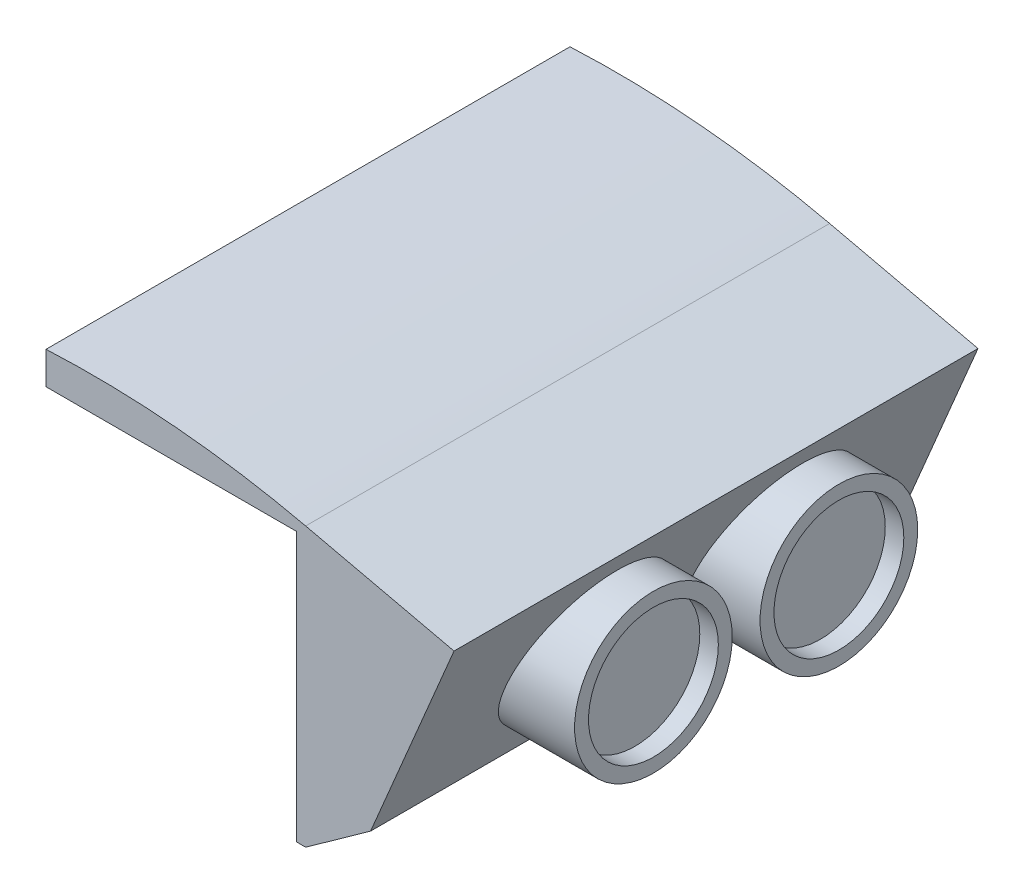
ISO-10303-21;
HEADER;
FILE_DESCRIPTION(('STEP AP214'),'2;1');
FILE_NAME('part.step','',(''),(''),'','','');
FILE_SCHEMA(('AUTOMOTIVE_DESIGN { 1 0 10303 214 1 1 1 1 }'));
ENDSEC;
DATA;
#1=APPLICATION_CONTEXT('core data for automotive mechanical design processes');
#2=APPLICATION_PROTOCOL_DEFINITION('international standard','automotive_design',2000,#1);
#3=PRODUCT_CONTEXT('',#1,'mechanical');
#4=PRODUCT('Part','Part','',(#3));
#5=PRODUCT_RELATED_PRODUCT_CATEGORY('part','',(#4));
#6=PRODUCT_DEFINITION_FORMATION('','',#4);
#7=PRODUCT_DEFINITION_CONTEXT('part definition',#1,'design');
#8=PRODUCT_DEFINITION('design','',#6,#7);
#9=PRODUCT_DEFINITION_SHAPE('','',#8);
#10=(LENGTH_UNIT() NAMED_UNIT(*) SI_UNIT(.MILLI.,.METRE.));
#11=(NAMED_UNIT(*) PLANE_ANGLE_UNIT() SI_UNIT($,.RADIAN.));
#12=(NAMED_UNIT(*) SI_UNIT($,.STERADIAN.) SOLID_ANGLE_UNIT());
#13=UNCERTAINTY_MEASURE_WITH_UNIT(LENGTH_MEASURE(1.E-05),#10,'distance_accuracy_value','');
#14=(GEOMETRIC_REPRESENTATION_CONTEXT(3) GLOBAL_UNCERTAINTY_ASSIGNED_CONTEXT((#13)) GLOBAL_UNIT_ASSIGNED_CONTEXT((#10,
#11,#12)) REPRESENTATION_CONTEXT('',''));
#15=CARTESIAN_POINT('',(0.,0.,0.));
#16=DIRECTION('',(0.,0.,1.));
#17=DIRECTION('',(1.,0.,0.));
#18=AXIS2_PLACEMENT_3D('',#15,#16,#17);
#19=CARTESIAN_POINT('',(-15.,-1.5,17.5));
#20=DIRECTION('',(0.,0.,-1.));
#21=DIRECTION('',(1.,0.,0.));
#22=AXIS2_PLACEMENT_3D('',#19,#20,#21);
#23=PLANE('',#22);
#24=DIRECTION('',(-1.,0.,0.));
#25=VECTOR('',#24,1.);
#26=CARTESIAN_POINT('',(-14.,-1.,17.5));
#27=LINE('',#26,#25);
#28=CARTESIAN_POINT('',(-12.5,-1.,17.5));
#29=VERTEX_POINT('',#28);
#30=CARTESIAN_POINT('',(-14.,-1.,17.5));
#31=VERTEX_POINT('',#30);
#32=EDGE_CURVE('E237',#29,#31,#27,.T.);
#33=ORIENTED_EDGE('',*,*,#32,.F.);
#34=DIRECTION('',(0.832050294337844,0.554700196225229,0.));
#35=VECTOR('',#34,1.);
#36=CARTESIAN_POINT('',(-14.,-2.,17.5));
#37=LINE('',#36,#35);
#38=CARTESIAN_POINT('',(-14.,-2.,17.5));
#39=VERTEX_POINT('',#38);
#40=EDGE_CURVE('E239',#39,#29,#37,.T.);
#41=ORIENTED_EDGE('',*,*,#40,.F.);
#42=DIRECTION('',(-1.,0.,0.));
#43=VECTOR('',#42,1.);
#44=CARTESIAN_POINT('',(-14.,-2.,17.5));
#45=LINE('',#44,#43);
#46=CARTESIAN_POINT('',(-15.,-2.,17.5));
#47=VERTEX_POINT('',#46);
#48=EDGE_CURVE('E243',#39,#47,#45,.T.);
#49=ORIENTED_EDGE('',*,*,#48,.T.);
#50=CARTESIAN_POINT('',(-15.,-1.5,17.5));
#51=DIRECTION('',(0.,0.,1.));
#52=DIRECTION('',(1.,0.,0.));
#53=AXIS2_PLACEMENT_3D('',#50,#51,#52);
#54=CIRCLE('',#53,0.5);
#55=CARTESIAN_POINT('',(-15.,-1.,17.5));
#56=VERTEX_POINT('',#55);
#57=EDGE_CURVE('E245',#56,#47,#54,.T.);
#58=ORIENTED_EDGE('',*,*,#57,.F.);
#59=EDGE_CURVE('E240',#31,#56,#27,.T.);
#60=ORIENTED_EDGE('',*,*,#59,.F.);
#61=EDGE_LOOP('',(#33,#41,#49,#58,#60));
#62=FACE_BOUND('',#61,.T.);
#63=CARTESIAN_POINT('',(-15.,-1.5,17.5));
#64=DIRECTION('',(0.,0.,-1.));
#65=DIRECTION('',(-1.,0.,0.));
#66=AXIS2_PLACEMENT_3D('',#63,#64,#65);
#67=CIRCLE('',#66,0.349999999999999);
#68=CARTESIAN_POINT('',(-15.35,-1.5,17.5));
#69=VERTEX_POINT('',#68);
#70=EDGE_CURVE('E233',#69,#69,#67,.T.);
#71=ORIENTED_EDGE('',*,*,#70,.F.);
#72=EDGE_LOOP('',(#71));
#73=FACE_BOUND('',#72,.T.);
#74=ADVANCED_FACE('F36',(#62,#73),#23,.T.);
#75=CARTESIAN_POINT('',(-15.,-1.5,22.5));
#76=DIRECTION('',(0.,0.,-1.));
#77=DIRECTION('',(1.,0.,0.));
#78=AXIS2_PLACEMENT_3D('',#75,#76,#77);
#79=PLANE('',#78);
#80=DIRECTION('',(-1.,0.,0.));
#81=VECTOR('',#80,1.);
#82=CARTESIAN_POINT('',(-12.5,-1.,22.5));
#83=LINE('',#82,#81);
#84=CARTESIAN_POINT('',(-12.5,-1.,22.5));
#85=VERTEX_POINT('',#84);
#86=CARTESIAN_POINT('',(-14.,-1.,22.5));
#87=VERTEX_POINT('',#86);
#88=EDGE_CURVE('E56',#85,#87,#83,.T.);
#89=ORIENTED_EDGE('',*,*,#88,.T.);
#90=CARTESIAN_POINT('',(-15.,-1.,22.5));
#91=VERTEX_POINT('',#90);
#92=EDGE_CURVE('E236',#87,#91,#83,.T.);
#93=ORIENTED_EDGE('',*,*,#92,.T.);
#94=CARTESIAN_POINT('',(-15.,-1.5,22.5));
#95=DIRECTION('',(0.,0.,1.));
#96=DIRECTION('',(1.,0.,0.));
#97=AXIS2_PLACEMENT_3D('',#94,#95,#96);
#98=CIRCLE('',#97,0.5);
#99=CARTESIAN_POINT('',(-15.,-2.,22.5));
#100=VERTEX_POINT('',#99);
#101=EDGE_CURVE('E256',#91,#100,#98,.T.);
#102=ORIENTED_EDGE('',*,*,#101,.T.);
#103=DIRECTION('',(-1.,0.,0.));
#104=VECTOR('',#103,1.);
#105=CARTESIAN_POINT('',(-14.,-2.,22.5));
#106=LINE('',#105,#104);
#107=CARTESIAN_POINT('',(-14.,-2.,22.5));
#108=VERTEX_POINT('',#107);
#109=EDGE_CURVE('E253',#108,#100,#106,.T.);
#110=ORIENTED_EDGE('',*,*,#109,.F.);
#111=DIRECTION('',(0.832050294337844,0.554700196225229,0.));
#112=VECTOR('',#111,1.);
#113=CARTESIAN_POINT('',(-14.,-2.,22.5));
#114=LINE('',#113,#112);
#115=EDGE_CURVE('E250',#108,#85,#114,.T.);
#116=ORIENTED_EDGE('',*,*,#115,.T.);
#117=EDGE_LOOP('',(#89,#93,#102,#110,#116));
#118=FACE_BOUND('',#117,.T.);
#119=CARTESIAN_POINT('',(-15.,-1.5,22.5));
#120=DIRECTION('',(0.,0.,-1.));
#121=DIRECTION('',(-1.,0.,0.));
#122=AXIS2_PLACEMENT_3D('',#119,#120,#121);
#123=CIRCLE('',#122,0.349999999999999);
#124=CARTESIAN_POINT('',(-15.35,-1.5,22.5));
#125=VERTEX_POINT('',#124);
#126=EDGE_CURVE('E230',#125,#125,#123,.T.);
#127=ORIENTED_EDGE('',*,*,#126,.T.);
#128=EDGE_LOOP('',(#127));
#129=FACE_BOUND('',#128,.T.);
#130=ADVANCED_FACE('F411',(#118,#129),#79,.F.);
#131=CARTESIAN_POINT('',(-14.,-30.,-28.25));
#132=DIRECTION('',(-1.,0.,0.));
#133=DIRECTION('',(0.,0.,1.));
#134=AXIS2_PLACEMENT_3D('',#131,#132,#133);
#135=PLANE('',#134);
#136=DIRECTION('',(0.,0.,-1.));
#137=VECTOR('',#136,1.);
#138=CARTESIAN_POINT('',(-14.,-6.63508326896291,56.0154341555881));
#139=LINE('',#138,#137);
#140=CARTESIAN_POINT('',(-14.,-6.63508326896291,-27.25));
#141=VERTEX_POINT('',#140);
#142=CARTESIAN_POINT('',(-14.,-6.63508326896291,-28.25));
#143=VERTEX_POINT('',#142);
#144=EDGE_CURVE('E334',#141,#143,#139,.T.);
#145=ORIENTED_EDGE('',*,*,#144,.F.);
#146=DIRECTION('',(0.,1.,0.));
#147=VECTOR('',#146,1.);
#148=CARTESIAN_POINT('',(-14.,-30.,-27.25));
#149=LINE('',#148,#147);
#150=CARTESIAN_POINT('',(-14.,-1.,-27.25));
#151=VERTEX_POINT('',#150);
#152=EDGE_CURVE('E313',#141,#151,#149,.T.);
#153=ORIENTED_EDGE('',*,*,#152,.T.);
#154=DIRECTION('',(0.,0.,1.));
#155=VECTOR('',#154,1.);
#156=CARTESIAN_POINT('',(-14.,-1.,0.));
#157=LINE('',#156,#155);
#158=CARTESIAN_POINT('',(-14.,-1.,-22.5));
#159=VERTEX_POINT('',#158);
#160=EDGE_CURVE('E328',#151,#159,#157,.T.);
#161=ORIENTED_EDGE('',*,*,#160,.T.);
#162=CARTESIAN_POINT('',(-14.,-1.,-17.5));
#163=VERTEX_POINT('',#162);
#164=EDGE_CURVE('E331',#159,#163,#157,.T.);
#165=ORIENTED_EDGE('',*,*,#164,.T.);
#166=EDGE_CURVE('E838',#163,#31,#157,.T.);
#167=ORIENTED_EDGE('',*,*,#166,.T.);
#168=EDGE_CURVE('E840',#31,#87,#157,.T.);
#169=ORIENTED_EDGE('',*,*,#168,.T.);
#170=CARTESIAN_POINT('',(-14.,-1.,28.25));
#171=VERTEX_POINT('',#170);
#172=EDGE_CURVE('E185',#87,#171,#157,.T.);
#173=ORIENTED_EDGE('',*,*,#172,.T.);
#174=DIRECTION('',(0.,1.,0.));
#175=VECTOR('',#174,1.);
#176=CARTESIAN_POINT('',(-14.,-30.,28.25));
#177=LINE('',#176,#175);
#178=CARTESIAN_POINT('',(-14.,2.5,28.25));
#179=VERTEX_POINT('',#178);
#180=EDGE_CURVE('E178',#171,#179,#177,.T.);
#181=ORIENTED_EDGE('',*,*,#180,.T.);
#182=DIRECTION('',(0.,0.,-1.));
#183=VECTOR('',#182,1.);
#184=CARTESIAN_POINT('',(-14.,2.5,62.25));
#185=LINE('',#184,#183);
#186=CARTESIAN_POINT('',(-14.,2.5,-28.25));
#187=VERTEX_POINT('',#186);
#188=EDGE_CURVE('E183',#179,#187,#185,.T.);
#189=ORIENTED_EDGE('',*,*,#188,.T.);
#190=DIRECTION('',(0.,1.,0.));
#191=VECTOR('',#190,1.);
#192=CARTESIAN_POINT('',(-14.,-30.,-28.25));
#193=LINE('',#192,#191);
#194=EDGE_CURVE('E189',#143,#187,#193,.T.);
#195=ORIENTED_EDGE('',*,*,#194,.F.);
#196=EDGE_LOOP('',(#145,#153,#161,#165,#167,#169,#173,#181,#189,#195));
#197=FACE_BOUND('',#196,.T.);
#198=ADVANCED_FACE('F38',(#197),#135,.T.);
#199=CARTESIAN_POINT('',(0.,-30.,0.));
#200=DIRECTION('',(0.,1.,0.));
#201=DIRECTION('',(0.,0.,1.));
#202=AXIS2_PLACEMENT_3D('',#199,#200,#201);
#203=PLANE('',#202);
#204=DIRECTION('',(1.,0.,0.));
#205=VECTOR('',#204,1.);
#206=CARTESIAN_POINT('',(0.,-30.,-27.25));
#207=LINE('',#206,#205);
#208=CARTESIAN_POINT('',(1.,-30.,-27.25));
#209=VERTEX_POINT('',#208);
#210=CARTESIAN_POINT('',(13.,-30.,-27.25));
#211=VERTEX_POINT('',#210);
#212=EDGE_CURVE('E323',#209,#211,#207,.T.);
#213=ORIENTED_EDGE('',*,*,#212,.F.);
#214=DIRECTION('',(0.,0.,-1.));
#215=VECTOR('',#214,1.);
#216=CARTESIAN_POINT('',(1.,-30.,56.0154341555881));
#217=LINE('',#216,#215);
#218=CARTESIAN_POINT('',(1.,-30.,-28.25));
#219=VERTEX_POINT('',#218);
#220=EDGE_CURVE('E338',#209,#219,#217,.T.);
#221=ORIENTED_EDGE('',*,*,#220,.T.);
#222=DIRECTION('',(1.,0.,0.));
#223=VECTOR('',#222,1.);
#224=CARTESIAN_POINT('',(-14.,-30.,-28.25));
#225=LINE('',#224,#223);
#226=CARTESIAN_POINT('',(14.,-30.,-28.25));
#227=VERTEX_POINT('',#226);
#228=EDGE_CURVE('E190',#219,#227,#225,.T.);
#229=ORIENTED_EDGE('',*,*,#228,.T.);
#230=DIRECTION('',(0.,0.,1.));
#231=VECTOR('',#230,1.);
#232=CARTESIAN_POINT('',(14.,-30.,-28.25));
#233=LINE('',#232,#231);
#234=CARTESIAN_POINT('',(14.,-30.,28.25));
#235=VERTEX_POINT('',#234);
#236=EDGE_CURVE('E349',#227,#235,#233,.T.);
#237=ORIENTED_EDGE('',*,*,#236,.T.);
#238=DIRECTION('',(1.,0.,0.));
#239=VECTOR('',#238,1.);
#240=CARTESIAN_POINT('',(-14.,-30.,28.25));
#241=LINE('',#240,#239);
#242=CARTESIAN_POINT('',(13.,-30.,28.25));
#243=VERTEX_POINT('',#242);
#244=EDGE_CURVE('E347',#243,#235,#241,.T.);
#245=ORIENTED_EDGE('',*,*,#244,.F.);
#246=DIRECTION('',(0.,0.,1.));
#247=VECTOR('',#246,1.);
#248=CARTESIAN_POINT('',(13.,-30.,0.));
#249=LINE('',#248,#247);
#250=EDGE_CURVE('E308',#211,#243,#249,.T.);
#251=ORIENTED_EDGE('',*,*,#250,.F.);
#252=EDGE_LOOP('',(#213,#221,#229,#237,#245,#251));
#253=FACE_BOUND('',#252,.T.);
#254=ADVANCED_FACE('F386',(#253),#203,.F.);
#255=CARTESIAN_POINT('',(-19.,-26.,56.0154341555881));
#256=DIRECTION('',(0.,0.,-1.));
#257=DIRECTION('',(-1.,0.,0.));
#258=AXIS2_PLACEMENT_3D('',#255,#256,#257);
#259=CYLINDRICAL_SURFACE('',#258,20.);
#260=DIRECTION('',(0.,0.,-1.));
#261=VECTOR('',#260,1.);
#262=CARTESIAN_POINT('',(1.,-26.,56.0154341555881));
#263=LINE('',#262,#261);
#264=CARTESIAN_POINT('',(1.,-26.,-27.25));
#265=VERTEX_POINT('',#264);
#266=CARTESIAN_POINT('',(1.,-26.,-28.25));
#267=VERTEX_POINT('',#266);
#268=EDGE_CURVE('E339',#265,#267,#263,.T.);
#269=ORIENTED_EDGE('',*,*,#268,.F.);
#270=CARTESIAN_POINT('',(-19.,-26.,-27.25));
#271=DIRECTION('',(0.,0.,1.));
#272=DIRECTION('',(1.,0.,0.));
#273=AXIS2_PLACEMENT_3D('',#270,#271,#272);
#274=CIRCLE('',#273,20.);
#275=EDGE_CURVE('E305',#265,#141,#274,.T.);
#276=ORIENTED_EDGE('',*,*,#275,.T.);
#277=ORIENTED_EDGE('',*,*,#144,.T.);
#278=CARTESIAN_POINT('',(-19.,-26.,-28.25));
#279=DIRECTION('',(0.,0.,1.));
#280=DIRECTION('',(1.,0.,0.));
#281=AXIS2_PLACEMENT_3D('',#278,#279,#280);
#282=CIRCLE('',#281,20.);
#283=EDGE_CURVE('E335',#267,#143,#282,.T.);
#284=ORIENTED_EDGE('',*,*,#283,.F.);
#285=EDGE_LOOP('',(#269,#276,#277,#284));
#286=FACE_BOUND('',#285,.T.);
#287=ADVANCED_FACE('F376',(#286),#259,.F.);
#288=CARTESIAN_POINT('',(1.,-30.,56.0154341555881));
#289=DIRECTION('',(-1.,0.,0.));
#290=DIRECTION('',(0.,0.,1.));
#291=AXIS2_PLACEMENT_3D('',#288,#289,#290);
#292=PLANE('',#291);
#293=ORIENTED_EDGE('',*,*,#220,.F.);
#294=DIRECTION('',(0.,1.,0.));
#295=VECTOR('',#294,1.);
#296=CARTESIAN_POINT('',(1.,-30.,-27.25));
#297=LINE('',#296,#295);
#298=EDGE_CURVE('E320',#209,#265,#297,.T.);
#299=ORIENTED_EDGE('',*,*,#298,.T.);
#300=ORIENTED_EDGE('',*,*,#268,.T.);
#301=DIRECTION('',(0.,1.,0.));
#302=VECTOR('',#301,1.);
#303=CARTESIAN_POINT('',(1.,-30.,-28.25));
#304=LINE('',#303,#302);
#305=EDGE_CURVE('E340',#219,#267,#304,.T.);
#306=ORIENTED_EDGE('',*,*,#305,.F.);
#307=EDGE_LOOP('',(#293,#299,#300,#306));
#308=FACE_BOUND('',#307,.T.);
#309=ADVANCED_FACE('F382',(#308),#292,.T.);
#310=CARTESIAN_POINT('',(-14.,-30.,-28.25));
#311=DIRECTION('',(0.,0.,1.));
#312=DIRECTION('',(1.,0.,0.));
#313=AXIS2_PLACEMENT_3D('',#310,#311,#312);
#314=PLANE('',#313);
#315=ORIENTED_EDGE('',*,*,#283,.T.);
#316=ORIENTED_EDGE('',*,*,#194,.T.);
#317=CARTESIAN_POINT('',(-9.07429940438824,-100.382153329148,-28.25));
#318=DIRECTION('',(0.,0.,-1.));
#319=DIRECTION('',(-1.,0.,0.));
#320=AXIS2_PLACEMENT_3D('',#317,#318,#319);
#321=CIRCLE('',#320,103.);
#322=CARTESIAN_POINT('',(14.,0.,-28.25));
#323=VERTEX_POINT('',#322);
#324=EDGE_CURVE('E200',#187,#323,#321,.T.);
#325=ORIENTED_EDGE('',*,*,#324,.T.);
#326=DIRECTION('',(0.974584012904353,-0.224022324314449,0.));
#327=VECTOR('',#326,1.);
#328=CARTESIAN_POINT('',(0.702604025077475,3.05660006134751,-28.25));
#329=LINE('',#328,#327);
#330=CARTESIAN_POINT('',(30.,-3.67783294366738,-28.25));
#331=VERTEX_POINT('',#330);
#332=EDGE_CURVE('E214',#323,#331,#329,.T.);
#333=ORIENTED_EDGE('',*,*,#332,.T.);
#334=DIRECTION('',(-0.388873289291879,-0.921291248669667,0.));
#335=VECTOR('',#334,1.);
#336=CARTESIAN_POINT('',(26.7809678190315,-11.304137601703,-28.25));
#337=LINE('',#336,#335);
#338=CARTESIAN_POINT('',(21.,-25.,-28.25));
#339=VERTEX_POINT('',#338);
#340=EDGE_CURVE('E204',#331,#339,#337,.T.);
#341=ORIENTED_EDGE('',*,*,#340,.T.);
#342=DIRECTION('',(-0.813733471206735,-0.581238193719096,0.));
#343=VECTOR('',#342,1.);
#344=CARTESIAN_POINT('',(18.9189189189189,-26.4864864864865,-28.25));
#345=LINE('',#344,#343);
#346=EDGE_CURVE('E207',#339,#227,#345,.T.);
#347=ORIENTED_EDGE('',*,*,#346,.T.);
#348=ORIENTED_EDGE('',*,*,#228,.F.);
#349=ORIENTED_EDGE('',*,*,#305,.T.);
#350=EDGE_LOOP('',(#315,#316,#325,#333,#341,#347,#348,#349));
#351=FACE_BOUND('',#350,.T.);
#352=ADVANCED_FACE('F372',(#351),#314,.F.);
#353=CARTESIAN_POINT('',(-14.,-30.,28.25));
#354=DIRECTION('',(0.,0.,1.));
#355=DIRECTION('',(1.,0.,0.));
#356=AXIS2_PLACEMENT_3D('',#353,#354,#355);
#357=PLANE('',#356);
#358=DIRECTION('',(0.,1.,0.));
#359=VECTOR('',#358,1.);
#360=CARTESIAN_POINT('',(13.,-30.,28.25));
#361=LINE('',#360,#359);
#362=CARTESIAN_POINT('',(13.,-1.,28.25));
#363=VERTEX_POINT('',#362);
#364=EDGE_CURVE('E314',#243,#363,#361,.T.);
#365=ORIENTED_EDGE('',*,*,#364,.F.);
#366=ORIENTED_EDGE('',*,*,#244,.T.);
#367=DIRECTION('',(-0.813733471206735,-0.581238193719096,0.));
#368=VECTOR('',#367,1.);
#369=CARTESIAN_POINT('',(18.9189189189189,-26.4864864864865,28.25));
#370=LINE('',#369,#368);
#371=CARTESIAN_POINT('',(21.,-25.,28.25));
#372=VERTEX_POINT('',#371);
#373=EDGE_CURVE('E217',#372,#235,#370,.T.);
#374=ORIENTED_EDGE('',*,*,#373,.F.);
#375=DIRECTION('',(-0.388873289291879,-0.921291248669667,0.));
#376=VECTOR('',#375,1.);
#377=CARTESIAN_POINT('',(26.7809678190315,-11.304137601703,28.25));
#378=LINE('',#377,#376);
#379=CARTESIAN_POINT('',(30.,-3.67783294366738,28.25));
#380=VERTEX_POINT('',#379);
#381=EDGE_CURVE('E222',#380,#372,#378,.T.);
#382=ORIENTED_EDGE('',*,*,#381,.F.);
#383=DIRECTION('',(0.974584012904353,-0.224022324314449,0.));
#384=VECTOR('',#383,1.);
#385=CARTESIAN_POINT('',(0.702604025077475,3.05660006134751,28.25));
#386=LINE('',#385,#384);
#387=CARTESIAN_POINT('',(14.,0.,28.25));
#388=VERTEX_POINT('',#387);
#389=EDGE_CURVE('E197',#388,#380,#386,.T.);
#390=ORIENTED_EDGE('',*,*,#389,.F.);
#391=CARTESIAN_POINT('',(-9.07429940438824,-100.382153329148,28.25));
#392=DIRECTION('',(0.,0.,1.));
#393=DIRECTION('',(1.,0.,0.));
#394=AXIS2_PLACEMENT_3D('',#391,#392,#393);
#395=CIRCLE('',#394,103.);
#396=EDGE_CURVE('E193',#179,#388,#395,.F.);
#397=ORIENTED_EDGE('',*,*,#396,.F.);
#398=ORIENTED_EDGE('',*,*,#180,.F.);
#399=DIRECTION('',(1.,0.,0.));
#400=VECTOR('',#399,1.);
#401=CARTESIAN_POINT('',(0.,-1.,28.25));
#402=LINE('',#401,#400);
#403=EDGE_CURVE('E317',#171,#363,#402,.T.);
#404=ORIENTED_EDGE('',*,*,#403,.T.);
#405=EDGE_LOOP('',(#365,#366,#374,#382,#390,#397,#398,#404));
#406=FACE_BOUND('',#405,.T.);
#407=ADVANCED_FACE('F195',(#406),#357,.T.);
#408=CARTESIAN_POINT('',(-14.,-30.,-27.25));
#409=DIRECTION('',(0.,0.,1.));
#410=DIRECTION('',(1.,0.,0.));
#411=AXIS2_PLACEMENT_3D('',#408,#409,#410);
#412=PLANE('',#411);
#413=ORIENTED_EDGE('',*,*,#275,.F.);
#414=ORIENTED_EDGE('',*,*,#298,.F.);
#415=ORIENTED_EDGE('',*,*,#212,.T.);
#416=DIRECTION('',(0.,1.,0.));
#417=VECTOR('',#416,1.);
#418=CARTESIAN_POINT('',(13.,-30.,-27.25));
#419=LINE('',#418,#417);
#420=CARTESIAN_POINT('',(13.,-1.,-27.25));
#421=VERTEX_POINT('',#420);
#422=EDGE_CURVE('E310',#211,#421,#419,.T.);
#423=ORIENTED_EDGE('',*,*,#422,.T.);
#424=DIRECTION('',(1.,0.,0.));
#425=VECTOR('',#424,1.);
#426=CARTESIAN_POINT('',(0.,-1.,-27.25));
#427=LINE('',#426,#425);
#428=EDGE_CURVE('E306',#151,#421,#427,.T.);
#429=ORIENTED_EDGE('',*,*,#428,.F.);
#430=ORIENTED_EDGE('',*,*,#152,.F.);
#431=EDGE_LOOP('',(#413,#414,#415,#423,#429,#430));
#432=FACE_BOUND('',#431,.T.);
#433=ADVANCED_FACE('F378',(#432),#412,.T.);
#434=CARTESIAN_POINT('',(13.,-30.,-28.25));
#435=DIRECTION('',(-1.,0.,0.));
#436=DIRECTION('',(0.,0.,1.));
#437=AXIS2_PLACEMENT_3D('',#434,#435,#436);
#438=PLANE('',#437);
#439=DIRECTION('',(0.,0.,1.));
#440=VECTOR('',#439,1.);
#441=CARTESIAN_POINT('',(13.,-1.,0.));
#442=LINE('',#441,#440);
#443=EDGE_CURVE('E309',#421,#363,#442,.T.);
#444=ORIENTED_EDGE('',*,*,#443,.F.);
#445=ORIENTED_EDGE('',*,*,#422,.F.);
#446=ORIENTED_EDGE('',*,*,#250,.T.);
#447=ORIENTED_EDGE('',*,*,#364,.T.);
#448=EDGE_LOOP('',(#444,#445,#446,#447));
#449=FACE_BOUND('',#448,.T.);
#450=ADVANCED_FACE('F393',(#449),#438,.T.);
#451=CARTESIAN_POINT('',(0.,-1.,0.));
#452=DIRECTION('',(0.,1.,0.));
#453=DIRECTION('',(0.,0.,1.));
#454=AXIS2_PLACEMENT_3D('',#451,#452,#453);
#455=PLANE('',#454);
#456=DIRECTION('',(0.,0.,1.));
#457=VECTOR('',#456,1.);
#458=CARTESIAN_POINT('',(-12.5,-1.,17.5));
#459=LINE('',#458,#457);
#460=EDGE_CURVE('E51',#29,#85,#459,.T.);
#461=ORIENTED_EDGE('',*,*,#460,.F.);
#462=ORIENTED_EDGE('',*,*,#32,.T.);
#463=ORIENTED_EDGE('',*,*,#166,.F.);
#464=DIRECTION('',(-1.,0.,0.));
#465=VECTOR('',#464,1.);
#466=CARTESIAN_POINT('',(-14.,-1.,-17.5));
#467=LINE('',#466,#465);
#468=CARTESIAN_POINT('',(-12.5,-1.,-17.5));
#469=VERTEX_POINT('',#468);
#470=EDGE_CURVE('E273',#469,#163,#467,.T.);
#471=ORIENTED_EDGE('',*,*,#470,.F.);
#472=DIRECTION('',(0.,0.,-1.));
#473=VECTOR('',#472,1.);
#474=CARTESIAN_POINT('',(-12.5,-1.,-17.5));
#475=LINE('',#474,#473);
#476=CARTESIAN_POINT('',(-12.5,-1.,-22.5));
#477=VERTEX_POINT('',#476);
#478=EDGE_CURVE('E285',#469,#477,#475,.T.);
#479=ORIENTED_EDGE('',*,*,#478,.T.);
#480=DIRECTION('',(-1.,0.,0.));
#481=VECTOR('',#480,1.);
#482=CARTESIAN_POINT('',(-12.5,-1.,-22.5));
#483=LINE('',#482,#481);
#484=EDGE_CURVE('E295',#477,#159,#483,.T.);
#485=ORIENTED_EDGE('',*,*,#484,.T.);
#486=ORIENTED_EDGE('',*,*,#160,.F.);
#487=ORIENTED_EDGE('',*,*,#428,.T.);
#488=ORIENTED_EDGE('',*,*,#443,.T.);
#489=ORIENTED_EDGE('',*,*,#403,.F.);
#490=ORIENTED_EDGE('',*,*,#172,.F.);
#491=ORIENTED_EDGE('',*,*,#88,.F.);
#492=EDGE_LOOP('',(#461,#462,#463,#471,#479,#485,#486,#487,#488,#489,#490,#491));
#493=FACE_BOUND('',#492,.T.);
#494=ADVANCED_FACE('F394',(#493),#455,.F.);
#495=CARTESIAN_POINT('',(-15.,-1.5,-17.5));
#496=DIRECTION('',(0.,0.,-1.));
#497=DIRECTION('',(-1.,0.,0.));
#498=AXIS2_PLACEMENT_3D('',#495,#496,#497);
#499=CYLINDRICAL_SURFACE('',#498,0.5);
#500=CARTESIAN_POINT('',(-15.,-1.5,-22.5));
#501=DIRECTION('',(0.,0.,1.));
#502=DIRECTION('',(1.,0.,0.));
#503=AXIS2_PLACEMENT_3D('',#500,#501,#502);
#504=CIRCLE('',#503,0.5);
#505=CARTESIAN_POINT('',(-15.,-1.,-22.5));
#506=VERTEX_POINT('',#505);
#507=CARTESIAN_POINT('',(-15.,-2.,-22.5));
#508=VERTEX_POINT('',#507);
#509=EDGE_CURVE('E272',#506,#508,#504,.T.);
#510=ORIENTED_EDGE('',*,*,#509,.T.);
#511=DIRECTION('',(0.,0.,-1.));
#512=VECTOR('',#511,1.);
#513=CARTESIAN_POINT('',(-15.,-2.,-17.5));
#514=LINE('',#513,#512);
#515=CARTESIAN_POINT('',(-15.,-2.,-17.5));
#516=VERTEX_POINT('',#515);
#517=EDGE_CURVE('E300',#516,#508,#514,.T.);
#518=ORIENTED_EDGE('',*,*,#517,.F.);
#519=CARTESIAN_POINT('',(-15.,-1.5,-17.5));
#520=DIRECTION('',(0.,0.,1.));
#521=DIRECTION('',(1.,0.,0.));
#522=AXIS2_PLACEMENT_3D('',#519,#520,#521);
#523=CIRCLE('',#522,0.5);
#524=CARTESIAN_POINT('',(-15.,-1.,-17.5));
#525=VERTEX_POINT('',#524);
#526=EDGE_CURVE('E276',#525,#516,#523,.T.);
#527=ORIENTED_EDGE('',*,*,#526,.F.);
#528=DIRECTION('',(0.,0.,-1.));
#529=VECTOR('',#528,1.);
#530=CARTESIAN_POINT('',(-15.,-1.,-17.5));
#531=LINE('',#530,#529);
#532=EDGE_CURVE('E302',#525,#506,#531,.T.);
#533=ORIENTED_EDGE('',*,*,#532,.T.);
#534=EDGE_LOOP('',(#510,#518,#527,#533));
#535=FACE_BOUND('',#534,.T.);
#536=ADVANCED_FACE('F459',(#535),#499,.T.);
#537=CARTESIAN_POINT('',(-14.,-2.,-17.5));
#538=DIRECTION('',(0.,-1.,0.));
#539=DIRECTION('',(0.,0.,-1.));
#540=AXIS2_PLACEMENT_3D('',#537,#538,#539);
#541=PLANE('',#540);
#542=DIRECTION('',(-1.,0.,0.));
#543=VECTOR('',#542,1.);
#544=CARTESIAN_POINT('',(-14.,-2.,-22.5));
#545=LINE('',#544,#543);
#546=CARTESIAN_POINT('',(-14.,-2.,-22.5));
#547=VERTEX_POINT('',#546);
#548=EDGE_CURVE('E288',#547,#508,#545,.T.);
#549=ORIENTED_EDGE('',*,*,#548,.F.);
#550=DIRECTION('',(0.,0.,-1.));
#551=VECTOR('',#550,1.);
#552=CARTESIAN_POINT('',(-14.,-2.,-17.5));
#553=LINE('',#552,#551);
#554=CARTESIAN_POINT('',(-14.,-2.,-17.5));
#555=VERTEX_POINT('',#554);
#556=EDGE_CURVE('E298',#555,#547,#553,.T.);
#557=ORIENTED_EDGE('',*,*,#556,.F.);
#558=DIRECTION('',(-1.,0.,0.));
#559=VECTOR('',#558,1.);
#560=CARTESIAN_POINT('',(-14.,-2.,-17.5));
#561=LINE('',#560,#559);
#562=EDGE_CURVE('E279',#555,#516,#561,.T.);
#563=ORIENTED_EDGE('',*,*,#562,.T.);
#564=ORIENTED_EDGE('',*,*,#517,.T.);
#565=EDGE_LOOP('',(#549,#557,#563,#564));
#566=FACE_BOUND('',#565,.T.);
#567=ADVANCED_FACE('F455',(#566),#541,.T.);
#568=CARTESIAN_POINT('',(-14.,-2.,-17.5));
#569=DIRECTION('',(-0.554700196225229,0.832050294337844,0.));
#570=DIRECTION('',(-0.832050294337844,-0.554700196225229,0.));
#571=AXIS2_PLACEMENT_3D('',#568,#569,#570);
#572=PLANE('',#571);
#573=DIRECTION('',(0.832050294337844,0.554700196225229,0.));
#574=VECTOR('',#573,1.);
#575=CARTESIAN_POINT('',(-14.,-2.,-22.5));
#576=LINE('',#575,#574);
#577=EDGE_CURVE('E291',#547,#477,#576,.T.);
#578=ORIENTED_EDGE('',*,*,#577,.T.);
#579=ORIENTED_EDGE('',*,*,#478,.F.);
#580=DIRECTION('',(0.832050294337844,0.554700196225229,0.));
#581=VECTOR('',#580,1.);
#582=CARTESIAN_POINT('',(-14.,-2.,-17.5));
#583=LINE('',#582,#581);
#584=EDGE_CURVE('E282',#555,#469,#583,.T.);
#585=ORIENTED_EDGE('',*,*,#584,.F.);
#586=ORIENTED_EDGE('',*,*,#556,.T.);
#587=EDGE_LOOP('',(#578,#579,#585,#586));
#588=FACE_BOUND('',#587,.T.);
#589=ADVANCED_FACE('F451',(#588),#572,.F.);
#590=CARTESIAN_POINT('',(-12.5,-1.,-17.5));
#591=DIRECTION('',(0.,-1.,0.));
#592=DIRECTION('',(0.,0.,-1.));
#593=AXIS2_PLACEMENT_3D('',#590,#591,#592);
#594=PLANE('',#593);
#595=ORIENTED_EDGE('',*,*,#164,.F.);
#596=EDGE_CURVE('E294',#159,#506,#483,.T.);
#597=ORIENTED_EDGE('',*,*,#596,.T.);
#598=ORIENTED_EDGE('',*,*,#532,.F.);
#599=EDGE_CURVE('E277',#163,#525,#467,.T.);
#600=ORIENTED_EDGE('',*,*,#599,.F.);
#601=EDGE_LOOP('',(#595,#597,#598,#600));
#602=FACE_BOUND('',#601,.T.);
#603=ADVANCED_FACE('F444',(#602),#594,.F.);
#604=CARTESIAN_POINT('',(-15.,-1.5,-17.5));
#605=DIRECTION('',(0.,0.,1.));
#606=DIRECTION('',(1.,0.,0.));
#607=AXIS2_PLACEMENT_3D('',#604,#605,#606);
#608=PLANE('',#607);
#609=CARTESIAN_POINT('',(-15.,-1.5,-17.5));
#610=DIRECTION('',(0.,0.,1.));
#611=DIRECTION('',(1.,0.,0.));
#612=AXIS2_PLACEMENT_3D('',#609,#610,#611);
#613=CIRCLE('',#612,0.349999999999999);
#614=CARTESIAN_POINT('',(-14.65,-1.5,-17.5));
#615=VERTEX_POINT('',#614);
#616=EDGE_CURVE('E269',#615,#615,#613,.F.);
#617=ORIENTED_EDGE('',*,*,#616,.T.);
#618=EDGE_LOOP('',(#617));
#619=FACE_BOUND('',#618,.T.);
#620=ORIENTED_EDGE('',*,*,#470,.T.);
#621=ORIENTED_EDGE('',*,*,#599,.T.);
#622=ORIENTED_EDGE('',*,*,#526,.T.);
#623=ORIENTED_EDGE('',*,*,#562,.F.);
#624=ORIENTED_EDGE('',*,*,#584,.T.);
#625=EDGE_LOOP('',(#620,#621,#622,#623,#624));
#626=FACE_BOUND('',#625,.T.);
#627=ADVANCED_FACE('F441',(#619,#626),#608,.T.);
#628=CARTESIAN_POINT('',(-15.,-1.5,-22.5));
#629=DIRECTION('',(0.,0.,1.));
#630=DIRECTION('',(1.,0.,0.));
#631=AXIS2_PLACEMENT_3D('',#628,#629,#630);
#632=PLANE('',#631);
#633=CARTESIAN_POINT('',(-15.,-1.5,-22.5));
#634=DIRECTION('',(0.,0.,-1.));
#635=DIRECTION('',(-1.,0.,0.));
#636=AXIS2_PLACEMENT_3D('',#633,#634,#635);
#637=CIRCLE('',#636,0.349999999999999);
#638=CARTESIAN_POINT('',(-15.35,-1.5,-22.5));
#639=VERTEX_POINT('',#638);
#640=EDGE_CURVE('E266',#639,#639,#637,.T.);
#641=ORIENTED_EDGE('',*,*,#640,.F.);
#642=EDGE_LOOP('',(#641));
#643=FACE_BOUND('',#642,.T.);
#644=ORIENTED_EDGE('',*,*,#509,.F.);
#645=ORIENTED_EDGE('',*,*,#596,.F.);
#646=ORIENTED_EDGE('',*,*,#484,.F.);
#647=ORIENTED_EDGE('',*,*,#577,.F.);
#648=ORIENTED_EDGE('',*,*,#548,.T.);
#649=EDGE_LOOP('',(#644,#645,#646,#647,#648));
#650=FACE_BOUND('',#649,.T.);
#651=ADVANCED_FACE('F439',(#643,#650),#632,.F.);
#652=CARTESIAN_POINT('',(-15.,-1.5,-16.5100505063388));
#653=DIRECTION('',(0.,0.,-1.));
#654=DIRECTION('',(-1.,0.,0.));
#655=AXIS2_PLACEMENT_3D('',#652,#653,#654);
#656=CYLINDRICAL_SURFACE('',#655,0.349999999999999);
#657=ORIENTED_EDGE('',*,*,#640,.T.);
#658=EDGE_LOOP('',(#657));
#659=FACE_BOUND('',#658,.T.);
#660=ORIENTED_EDGE('',*,*,#616,.F.);
#661=EDGE_LOOP('',(#660));
#662=FACE_BOUND('',#661,.T.);
#663=ADVANCED_FACE('F435',(#659,#662),#656,.F.);
#664=CARTESIAN_POINT('',(-12.5,-1.,17.5));
#665=DIRECTION('',(0.,1.,0.));
#666=DIRECTION('',(0.,0.,1.));
#667=AXIS2_PLACEMENT_3D('',#664,#665,#666);
#668=PLANE('',#667);
#669=ORIENTED_EDGE('',*,*,#92,.F.);
#670=ORIENTED_EDGE('',*,*,#168,.F.);
#671=ORIENTED_EDGE('',*,*,#59,.T.);
#672=DIRECTION('',(0.,0.,1.));
#673=VECTOR('',#672,1.);
#674=CARTESIAN_POINT('',(-15.,-1.,17.5));
#675=LINE('',#674,#673);
#676=EDGE_CURVE('E248',#56,#91,#675,.T.);
#677=ORIENTED_EDGE('',*,*,#676,.T.);
#678=EDGE_LOOP('',(#669,#670,#671,#677));
#679=FACE_BOUND('',#678,.T.);
#680=ADVANCED_FACE('F431',(#679),#668,.T.);
#681=CARTESIAN_POINT('',(-14.,-2.,17.5));
#682=DIRECTION('',(0.554700196225229,-0.832050294337844,0.));
#683=DIRECTION('',(0.832050294337844,0.554700196225229,0.));
#684=AXIS2_PLACEMENT_3D('',#681,#682,#683);
#685=PLANE('',#684);
#686=ORIENTED_EDGE('',*,*,#115,.F.);
#687=DIRECTION('',(0.,0.,1.));
#688=VECTOR('',#687,1.);
#689=CARTESIAN_POINT('',(-14.,-2.,17.5));
#690=LINE('',#689,#688);
#691=EDGE_CURVE('E263',#39,#108,#690,.T.);
#692=ORIENTED_EDGE('',*,*,#691,.F.);
#693=ORIENTED_EDGE('',*,*,#40,.T.);
#694=ORIENTED_EDGE('',*,*,#460,.T.);
#695=EDGE_LOOP('',(#686,#692,#693,#694));
#696=FACE_BOUND('',#695,.T.);
#697=ADVANCED_FACE('F427',(#696),#685,.T.);
#698=CARTESIAN_POINT('',(-14.,-2.,17.5));
#699=DIRECTION('',(0.,1.,0.));
#700=DIRECTION('',(0.,0.,1.));
#701=AXIS2_PLACEMENT_3D('',#698,#699,#700);
#702=PLANE('',#701);
#703=ORIENTED_EDGE('',*,*,#109,.T.);
#704=DIRECTION('',(0.,0.,1.));
#705=VECTOR('',#704,1.);
#706=CARTESIAN_POINT('',(-15.,-2.,17.5));
#707=LINE('',#706,#705);
#708=EDGE_CURVE('E261',#47,#100,#707,.T.);
#709=ORIENTED_EDGE('',*,*,#708,.F.);
#710=ORIENTED_EDGE('',*,*,#48,.F.);
#711=ORIENTED_EDGE('',*,*,#691,.T.);
#712=EDGE_LOOP('',(#703,#709,#710,#711));
#713=FACE_BOUND('',#712,.T.);
#714=ADVANCED_FACE('F423',(#713),#702,.F.);
#715=CARTESIAN_POINT('',(-15.,-1.5,17.5));
#716=DIRECTION('',(0.,0.,1.));
#717=DIRECTION('',(1.,0.,0.));
#718=AXIS2_PLACEMENT_3D('',#715,#716,#717);
#719=CYLINDRICAL_SURFACE('',#718,0.5);
#720=ORIENTED_EDGE('',*,*,#101,.F.);
#721=ORIENTED_EDGE('',*,*,#676,.F.);
#722=ORIENTED_EDGE('',*,*,#57,.T.);
#723=ORIENTED_EDGE('',*,*,#708,.T.);
#724=EDGE_LOOP('',(#720,#721,#722,#723));
#725=FACE_BOUND('',#724,.T.);
#726=ADVANCED_FACE('F407',(#725),#719,.T.);
#727=CARTESIAN_POINT('',(-15.,-1.5,-18.4899494936612));
#728=DIRECTION('',(0.,0.,1.));
#729=DIRECTION('',(1.,0.,0.));
#730=AXIS2_PLACEMENT_3D('',#727,#728,#729);
#731=CYLINDRICAL_SURFACE('',#730,0.349999999999999);
#732=ORIENTED_EDGE('',*,*,#126,.F.);
#733=EDGE_LOOP('',(#732));
#734=FACE_BOUND('',#733,.T.);
#735=ORIENTED_EDGE('',*,*,#70,.T.);
#736=EDGE_LOOP('',(#735));
#737=FACE_BOUND('',#736,.T.);
#738=ADVANCED_FACE('F400',(#734,#737),#731,.F.);
#739=CARTESIAN_POINT('',(18.9189189189189,-26.4864864864865,62.25));
#740=DIRECTION('',(0.581238193719096,-0.813733471206735,0.));
#741=DIRECTION('',(0.813733471206735,0.581238193719096,0.));
#742=AXIS2_PLACEMENT_3D('',#739,#740,#741);
#743=PLANE('',#742);
#744=DIRECTION('',(0.,0.,-1.));
#745=VECTOR('',#744,1.);
#746=CARTESIAN_POINT('',(21.,-25.,62.25));
#747=LINE('',#746,#745);
#748=EDGE_CURVE('E225',#372,#339,#747,.T.);
#749=ORIENTED_EDGE('',*,*,#748,.F.);
#750=ORIENTED_EDGE('',*,*,#373,.T.);
#751=ORIENTED_EDGE('',*,*,#236,.F.);
#752=ORIENTED_EDGE('',*,*,#346,.F.);
#753=EDGE_LOOP('',(#749,#750,#751,#752));
#754=FACE_BOUND('',#753,.T.);
#755=ADVANCED_FACE('F398',(#754),#743,.T.);
#756=CARTESIAN_POINT('',(0.702604025077475,3.05660006134751,62.25));
#757=DIRECTION('',(0.224022324314449,0.974584012904353,0.));
#758=DIRECTION('',(-0.974584012904353,0.224022324314449,0.));
#759=AXIS2_PLACEMENT_3D('',#756,#757,#758);
#760=PLANE('',#759);
#761=DIRECTION('',(0.,0.,1.));
#762=VECTOR('',#761,1.);
#763=CARTESIAN_POINT('',(14.,0.,-28.25));
#764=LINE('',#763,#762);
#765=EDGE_CURVE('E343',#323,#388,#764,.T.);
#766=ORIENTED_EDGE('',*,*,#765,.T.);
#767=ORIENTED_EDGE('',*,*,#389,.T.);
#768=DIRECTION('',(0.,0.,-1.));
#769=VECTOR('',#768,1.);
#770=CARTESIAN_POINT('',(30.,-3.67783294366738,62.25));
#771=LINE('',#770,#769);
#772=EDGE_CURVE('E226',#380,#331,#771,.T.);
#773=ORIENTED_EDGE('',*,*,#772,.T.);
#774=ORIENTED_EDGE('',*,*,#332,.F.);
#775=EDGE_LOOP('',(#766,#767,#773,#774));
#776=FACE_BOUND('',#775,.T.);
#777=ADVANCED_FACE('F363',(#776),#760,.T.);
#778=CARTESIAN_POINT('',(26.7809678190315,-11.304137601703,62.25));
#779=DIRECTION('',(0.921291248669667,-0.388873289291879,0.));
#780=DIRECTION('',(0.388873289291879,0.921291248669667,0.));
#781=AXIS2_PLACEMENT_3D('',#778,#779,#780);
#782=PLANE('',#781);
#783=CARTESIAN_POINT('',(25.5,-14.3389164718337,9.75));
#784=DIRECTION('',(0.921291248669667,-0.388873289291879,0.));
#785=DIRECTION('',(0.388873289291879,0.921291248669667,0.));
#786=AXIS2_PLACEMENT_3D('',#783,#784,#785);
#787=ELLIPSE('',#786,9.22618120195312,8.5);
#788=CARTESIAN_POINT('',(29.0878154316064,-5.83891647183369,9.75));
#789=VERTEX_POINT('',#788);
#790=EDGE_CURVE('E11',#789,#789,#787,.T.);
#791=ORIENTED_EDGE('',*,*,#790,.F.);
#792=EDGE_LOOP('',(#791));
#793=FACE_BOUND('',#792,.T.);
#794=CARTESIAN_POINT('',(25.5,-14.3389164718337,-10.25));
#795=DIRECTION('',(0.921291248669667,-0.388873289291879,0.));
#796=DIRECTION('',(0.388873289291879,0.921291248669667,0.));
#797=AXIS2_PLACEMENT_3D('',#794,#795,#796);
#798=ELLIPSE('',#797,9.22618120195312,8.5);
#799=CARTESIAN_POINT('',(29.0878154316064,-5.83891647183369,-10.25));
#800=VERTEX_POINT('',#799);
#801=EDGE_CURVE('E44',#800,#800,#798,.T.);
#802=ORIENTED_EDGE('',*,*,#801,.F.);
#803=EDGE_LOOP('',(#802));
#804=FACE_BOUND('',#803,.T.);
#805=ORIENTED_EDGE('',*,*,#772,.F.);
#806=ORIENTED_EDGE('',*,*,#381,.T.);
#807=ORIENTED_EDGE('',*,*,#748,.T.);
#808=ORIENTED_EDGE('',*,*,#340,.F.);
#809=EDGE_LOOP('',(#805,#806,#807,#808));
#810=FACE_BOUND('',#809,.T.);
#811=ADVANCED_FACE('F360',(#793,#804,#810),#782,.T.);
#812=CARTESIAN_POINT('',(-9.07429940438824,-100.382153329148,62.25));
#813=DIRECTION('',(0.,0.,-1.));
#814=DIRECTION('',(-1.,0.,0.));
#815=AXIS2_PLACEMENT_3D('',#812,#813,#814);
#816=CYLINDRICAL_SURFACE('',#815,103.);
#817=ORIENTED_EDGE('',*,*,#188,.F.);
#818=ORIENTED_EDGE('',*,*,#396,.T.);
#819=ORIENTED_EDGE('',*,*,#765,.F.);
#820=ORIENTED_EDGE('',*,*,#324,.F.);
#821=EDGE_LOOP('',(#817,#818,#819,#820));
#822=FACE_BOUND('',#821,.T.);
#823=ADVANCED_FACE('F202',(#822),#816,.T.);
#824=CARTESIAN_POINT('',(0.431394135114893,-14.3389164718337,-10.25));
#825=DIRECTION('',(1.,0.,0.));
#826=DIRECTION('',(0.,0.,-1.));
#827=AXIS2_PLACEMENT_3D('',#824,#825,#826);
#828=CYLINDRICAL_SURFACE('',#827,8.5);
#829=ORIENTED_EDGE('',*,*,#801,.T.);
#830=EDGE_LOOP('',(#829));
#831=FACE_BOUND('',#830,.T.);
#832=CARTESIAN_POINT('',(33.,-14.3389164718337,-10.25));
#833=DIRECTION('',(1.,0.,0.));
#834=DIRECTION('',(0.,0.,-1.));
#835=AXIS2_PLACEMENT_3D('',#832,#833,#834);
#836=CIRCLE('',#835,8.5);
#837=CARTESIAN_POINT('',(33.,-14.3389164718337,-18.75));
#838=VERTEX_POINT('',#837);
#839=EDGE_CURVE('E210',#838,#838,#836,.T.);
#840=ORIENTED_EDGE('',*,*,#839,.F.);
#841=EDGE_LOOP('',(#840));
#842=FACE_BOUND('',#841,.T.);
#843=ADVANCED_FACE('F357',(#831,#842),#828,.T.);
#844=CARTESIAN_POINT('',(33.,-14.3389164718337,-10.25));
#845=DIRECTION('',(1.,0.,0.));
#846=DIRECTION('',(0.,0.,-1.));
#847=AXIS2_PLACEMENT_3D('',#844,#845,#846);
#848=PLANE('',#847);
#849=CARTESIAN_POINT('',(33.,-14.3389164718337,-10.25));
#850=DIRECTION('',(1.,0.,0.));
#851=DIRECTION('',(0.,0.,-1.));
#852=AXIS2_PLACEMENT_3D('',#849,#850,#851);
#853=CIRCLE('',#852,7.);
#854=CARTESIAN_POINT('',(33.,-14.3389164718337,-17.25));
#855=VERTEX_POINT('',#854);
#856=EDGE_CURVE('E777',#855,#855,#853,.T.);
#857=ORIENTED_EDGE('',*,*,#856,.F.);
#858=EDGE_LOOP('',(#857));
#859=FACE_BOUND('',#858,.T.);
#860=ORIENTED_EDGE('',*,*,#839,.T.);
#861=EDGE_LOOP('',(#860));
#862=FACE_BOUND('',#861,.T.);
#863=ADVANCED_FACE('F678',(#859,#862),#848,.T.);
#864=CARTESIAN_POINT('',(31.,-14.3389164718337,-10.25));
#865=DIRECTION('',(1.,0.,0.));
#866=DIRECTION('',(0.,0.,-1.));
#867=AXIS2_PLACEMENT_3D('',#864,#865,#866);
#868=CYLINDRICAL_SURFACE('',#867,7.);
#869=CARTESIAN_POINT('',(31.,-14.3389164718337,-10.25));
#870=DIRECTION('',(1.,0.,0.));
#871=DIRECTION('',(0.,0.,-1.));
#872=AXIS2_PLACEMENT_3D('',#869,#870,#871);
#873=CIRCLE('',#872,7.);
#874=CARTESIAN_POINT('',(31.,-14.3389164718337,-17.25));
#875=VERTEX_POINT('',#874);
#876=EDGE_CURVE('E782',#875,#875,#873,.T.);
#877=ORIENTED_EDGE('',*,*,#876,.F.);
#878=EDGE_LOOP('',(#877));
#879=FACE_BOUND('',#878,.T.);
#880=ORIENTED_EDGE('',*,*,#856,.T.);
#881=EDGE_LOOP('',(#880));
#882=FACE_BOUND('',#881,.T.);
#883=ADVANCED_FACE('F688',(#879,#882),#868,.F.);
#884=CARTESIAN_POINT('',(31.,-14.3389164718337,-10.25));
#885=DIRECTION('',(1.,0.,0.));
#886=DIRECTION('',(0.,0.,-1.));
#887=AXIS2_PLACEMENT_3D('',#884,#885,#886);
#888=PLANE('',#887);
#889=ORIENTED_EDGE('',*,*,#876,.T.);
#890=EDGE_LOOP('',(#889));
#891=FACE_BOUND('',#890,.T.);
#892=ADVANCED_FACE('F699',(#891),#888,.T.);
#893=CARTESIAN_POINT('',(0.431394135114893,-14.3389164718337,9.75));
#894=DIRECTION('',(1.,0.,0.));
#895=DIRECTION('',(0.,0.,-1.));
#896=AXIS2_PLACEMENT_3D('',#893,#894,#895);
#897=CYLINDRICAL_SURFACE('',#896,8.5);
#898=ORIENTED_EDGE('',*,*,#790,.T.);
#899=EDGE_LOOP('',(#898));
#900=FACE_BOUND('',#899,.T.);
#901=CARTESIAN_POINT('',(33.,-14.3389164718337,9.75));
#902=DIRECTION('',(1.,0.,0.));
#903=DIRECTION('',(0.,0.,-1.));
#904=AXIS2_PLACEMENT_3D('',#901,#902,#903);
#905=CIRCLE('',#904,8.5);
#906=CARTESIAN_POINT('',(33.,-14.3389164718337,1.25));
#907=VERTEX_POINT('',#906);
#908=EDGE_CURVE('E773',#907,#907,#905,.T.);
#909=ORIENTED_EDGE('',*,*,#908,.F.);
#910=EDGE_LOOP('',(#909));
#911=FACE_BOUND('',#910,.T.);
#912=ADVANCED_FACE('F710',(#900,#911),#897,.T.);
#913=CARTESIAN_POINT('',(33.,-14.3389164718337,9.75));
#914=DIRECTION('',(1.,0.,0.));
#915=DIRECTION('',(0.,0.,-1.));
#916=AXIS2_PLACEMENT_3D('',#913,#914,#915);
#917=PLANE('',#916);
#918=CARTESIAN_POINT('',(33.,-14.3389164718337,9.75));
#919=DIRECTION('',(1.,0.,0.));
#920=DIRECTION('',(0.,0.,-1.));
#921=AXIS2_PLACEMENT_3D('',#918,#919,#920);
#922=CIRCLE('',#921,7.);
#923=CARTESIAN_POINT('',(33.,-14.3389164718337,2.75));
#924=VERTEX_POINT('',#923);
#925=EDGE_CURVE('E774',#924,#924,#922,.T.);
#926=ORIENTED_EDGE('',*,*,#925,.F.);
#927=EDGE_LOOP('',(#926));
#928=FACE_BOUND('',#927,.T.);
#929=ORIENTED_EDGE('',*,*,#908,.T.);
#930=EDGE_LOOP('',(#929));
#931=FACE_BOUND('',#930,.T.);
#932=ADVANCED_FACE('F725',(#928,#931),#917,.T.);
#933=CARTESIAN_POINT('',(31.,-14.3389164718337,9.75));
#934=DIRECTION('',(1.,0.,0.));
#935=DIRECTION('',(0.,0.,-1.));
#936=AXIS2_PLACEMENT_3D('',#933,#934,#935);
#937=CYLINDRICAL_SURFACE('',#936,7.);
#938=CARTESIAN_POINT('',(31.,-14.3389164718337,9.75));
#939=DIRECTION('',(1.,0.,0.));
#940=DIRECTION('',(0.,0.,-1.));
#941=AXIS2_PLACEMENT_3D('',#938,#939,#940);
#942=CIRCLE('',#941,7.);
#943=CARTESIAN_POINT('',(31.,-14.3389164718337,2.75));
#944=VERTEX_POINT('',#943);
#945=EDGE_CURVE('E772',#944,#944,#942,.T.);
#946=ORIENTED_EDGE('',*,*,#945,.F.);
#947=EDGE_LOOP('',(#946));
#948=FACE_BOUND('',#947,.T.);
#949=ORIENTED_EDGE('',*,*,#925,.T.);
#950=EDGE_LOOP('',(#949));
#951=FACE_BOUND('',#950,.T.);
#952=ADVANCED_FACE('F735',(#948,#951),#937,.F.);
#953=CARTESIAN_POINT('',(31.,-14.3389164718337,9.75));
#954=DIRECTION('',(1.,0.,0.));
#955=DIRECTION('',(0.,0.,-1.));
#956=AXIS2_PLACEMENT_3D('',#953,#954,#955);
#957=PLANE('',#956);
#958=ORIENTED_EDGE('',*,*,#945,.T.);
#959=EDGE_LOOP('',(#958));
#960=FACE_BOUND('',#959,.T.);
#961=ADVANCED_FACE('F745',(#960),#957,.T.);
#962=CLOSED_SHELL('',(#74,#130,#198,#254,#287,#309,#352,#407,#433,#450,#494,#536,#567,#589,#603,
#627,#651,#663,#680,#697,#714,#726,#738,#755,#777,#811,#823,#843,#863,#883,#892,#912,#932,#952,#961));
#963=MANIFOLD_SOLID_BREP('B2',#962);
#964=ADVANCED_BREP_SHAPE_REPRESENTATION('',(#18,#963),#14);
#965=SHAPE_DEFINITION_REPRESENTATION(#9,#964);
ENDSEC;
END-ISO-10303-21;
